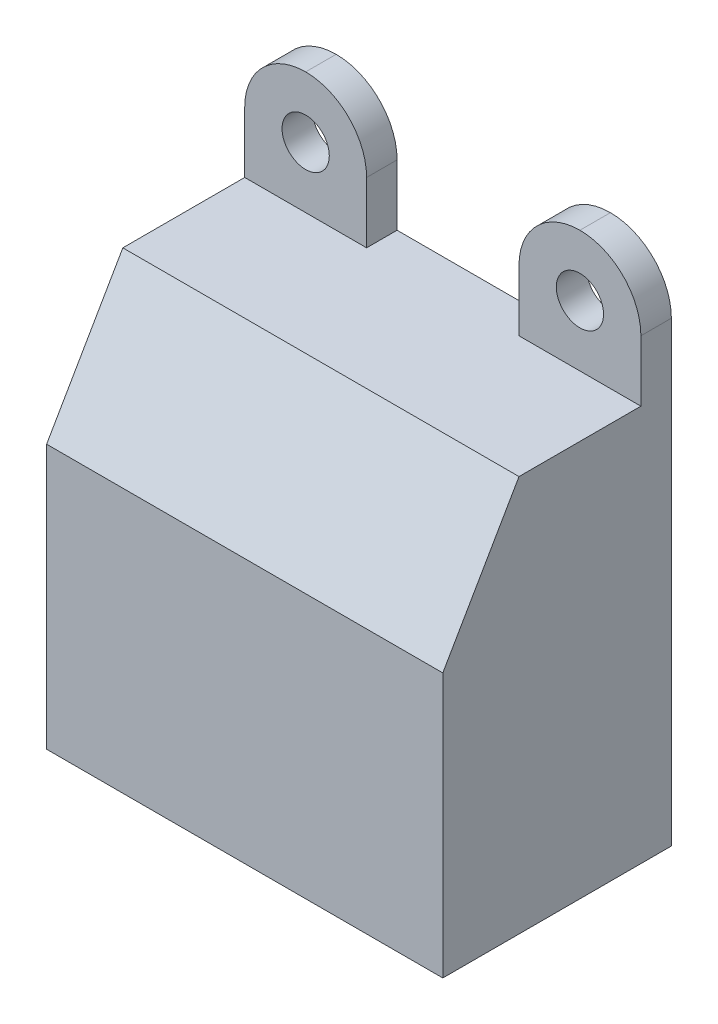
ISO-10303-21;
HEADER;
FILE_DESCRIPTION(('STEP AP214'),'2;1');
FILE_NAME('part.step','',(''),(''),'','','');
FILE_SCHEMA(('AUTOMOTIVE_DESIGN { 1 0 10303 214 1 1 1 1 }'));
ENDSEC;
DATA;
#1=APPLICATION_CONTEXT('core data for automotive mechanical design processes');
#2=APPLICATION_PROTOCOL_DEFINITION('international standard','automotive_design',2000,#1);
#3=PRODUCT_CONTEXT('',#1,'mechanical');
#4=PRODUCT('Part','Part','',(#3));
#5=PRODUCT_RELATED_PRODUCT_CATEGORY('part','',(#4));
#6=PRODUCT_DEFINITION_FORMATION('','',#4);
#7=PRODUCT_DEFINITION_CONTEXT('part definition',#1,'design');
#8=PRODUCT_DEFINITION('design','',#6,#7);
#9=PRODUCT_DEFINITION_SHAPE('','',#8);
#10=(LENGTH_UNIT() NAMED_UNIT(*) SI_UNIT(.MILLI.,.METRE.));
#11=(NAMED_UNIT(*) PLANE_ANGLE_UNIT() SI_UNIT($,.RADIAN.));
#12=(NAMED_UNIT(*) SI_UNIT($,.STERADIAN.) SOLID_ANGLE_UNIT());
#13=UNCERTAINTY_MEASURE_WITH_UNIT(LENGTH_MEASURE(1.E-05),#10,'distance_accuracy_value','');
#14=(GEOMETRIC_REPRESENTATION_CONTEXT(3) GLOBAL_UNCERTAINTY_ASSIGNED_CONTEXT((#13)) GLOBAL_UNIT_ASSIGNED_CONTEXT((#10,
#11,#12)) REPRESENTATION_CONTEXT('',''));
#15=CARTESIAN_POINT('',(0.,0.,0.));
#16=DIRECTION('',(0.,0.,1.));
#17=DIRECTION('',(1.,0.,0.));
#18=AXIS2_PLACEMENT_3D('',#15,#16,#17);
#19=CARTESIAN_POINT('',(70.,26.,15.));
#20=DIRECTION('',(0.,-1.,0.));
#21=DIRECTION('',(1.,0.,0.));
#22=AXIS2_PLACEMENT_3D('',#19,#20,#21);
#23=PLANE('',#22);
#24=DIRECTION('',(0.,0.,1.));
#25=VECTOR('',#24,1.);
#26=CARTESIAN_POINT('',(62.,26.,0.));
#27=LINE('',#26,#25);
#28=CARTESIAN_POINT('',(62.,26.,0.));
#29=VERTEX_POINT('',#28);
#30=CARTESIAN_POINT('',(62.,26.,2.));
#31=VERTEX_POINT('',#30);
#32=EDGE_CURVE('E135',#29,#31,#27,.T.);
#33=ORIENTED_EDGE('',*,*,#32,.F.);
#34=DIRECTION('',(-1.,0.,0.));
#35=VECTOR('',#34,1.);
#36=CARTESIAN_POINT('',(70.,26.,0.));
#37=LINE('',#36,#35);
#38=CARTESIAN_POINT('',(52.,26.,0.));
#39=VERTEX_POINT('',#38);
#40=EDGE_CURVE('E143',#29,#39,#37,.T.);
#41=ORIENTED_EDGE('',*,*,#40,.T.);
#42=DIRECTION('',(0.,0.,-1.));
#43=VECTOR('',#42,1.);
#44=CARTESIAN_POINT('',(52.,26.,0.));
#45=LINE('',#44,#43);
#46=CARTESIAN_POINT('',(52.,26.,2.));
#47=VERTEX_POINT('',#46);
#48=EDGE_CURVE('E173',#47,#39,#45,.T.);
#49=ORIENTED_EDGE('',*,*,#48,.F.);
#50=DIRECTION('',(1.,0.,0.));
#51=VECTOR('',#50,1.);
#52=CARTESIAN_POINT('',(44.,26.,2.));
#53=LINE('',#52,#51);
#54=CARTESIAN_POINT('',(44.,26.,2.));
#55=VERTEX_POINT('',#54);
#56=EDGE_CURVE('E139',#55,#47,#53,.T.);
#57=ORIENTED_EDGE('',*,*,#56,.F.);
#58=DIRECTION('',(0.,0.,-1.));
#59=VECTOR('',#58,1.);
#60=CARTESIAN_POINT('',(44.,26.,15.));
#61=LINE('',#60,#59);
#62=CARTESIAN_POINT('',(44.,26.,9.99999999999999));
#63=VERTEX_POINT('',#62);
#64=EDGE_CURVE('E224',#63,#55,#61,.T.);
#65=ORIENTED_EDGE('',*,*,#64,.F.);
#66=DIRECTION('',(1.,0.,0.));
#67=VECTOR('',#66,1.);
#68=CARTESIAN_POINT('',(70.,26.,9.99999999999999));
#69=LINE('',#68,#67);
#70=CARTESIAN_POINT('',(70.,26.,9.99999999999999));
#71=VERTEX_POINT('',#70);
#72=EDGE_CURVE('E246',#63,#71,#69,.T.);
#73=ORIENTED_EDGE('',*,*,#72,.T.);
#74=DIRECTION('',(0.,0.,-1.));
#75=VECTOR('',#74,1.);
#76=CARTESIAN_POINT('',(70.,26.,15.));
#77=LINE('',#76,#75);
#78=CARTESIAN_POINT('',(70.,26.,2.));
#79=VERTEX_POINT('',#78);
#80=EDGE_CURVE('E227',#71,#79,#77,.T.);
#81=ORIENTED_EDGE('',*,*,#80,.T.);
#82=DIRECTION('',(1.,0.,0.));
#83=VECTOR('',#82,1.);
#84=CARTESIAN_POINT('',(70.,26.,2.));
#85=LINE('',#84,#83);
#86=EDGE_CURVE('E156',#31,#79,#85,.T.);
#87=ORIENTED_EDGE('',*,*,#86,.F.);
#88=EDGE_LOOP('',(#33,#41,#49,#57,#65,#73,#81,#87));
#89=FACE_BOUND('',#88,.T.);
#90=ADVANCED_FACE('F33',(#89),#23,.F.);
#91=CARTESIAN_POINT('',(70.,0.,15.));
#92=DIRECTION('',(-1.,0.,0.));
#93=DIRECTION('',(0.,0.,1.));
#94=AXIS2_PLACEMENT_3D('',#91,#92,#93);
#95=PLANE('',#94);
#96=DIRECTION('',(0.,1.,0.));
#97=VECTOR('',#96,1.);
#98=CARTESIAN_POINT('',(70.,0.,0.));
#99=LINE('',#98,#97);
#100=CARTESIAN_POINT('',(70.,0.,0.));
#101=VERTEX_POINT('',#100);
#102=CARTESIAN_POINT('',(70.,30.,0.));
#103=VERTEX_POINT('',#102);
#104=EDGE_CURVE('E151',#101,#103,#99,.T.);
#105=ORIENTED_EDGE('',*,*,#104,.T.);
#106=DIRECTION('',(0.,0.,-1.));
#107=VECTOR('',#106,1.);
#108=CARTESIAN_POINT('',(70.,30.,15.));
#109=LINE('',#108,#107);
#110=CARTESIAN_POINT('',(70.,30.,2.));
#111=VERTEX_POINT('',#110);
#112=EDGE_CURVE('E193',#103,#111,#109,.F.);
#113=ORIENTED_EDGE('',*,*,#112,.T.);
#114=DIRECTION('',(0.,-1.,0.));
#115=VECTOR('',#114,1.);
#116=CARTESIAN_POINT('',(70.,34.,2.));
#117=LINE('',#116,#115);
#118=EDGE_CURVE('E159',#111,#79,#117,.T.);
#119=ORIENTED_EDGE('',*,*,#118,.T.);
#120=ORIENTED_EDGE('',*,*,#80,.F.);
#121=DIRECTION('',(0.,-0.866025403784438,0.500000000000001));
#122=VECTOR('',#121,1.);
#123=CARTESIAN_POINT('',(70.,17.3397459621556,15.));
#124=LINE('',#123,#122);
#125=CARTESIAN_POINT('',(70.,17.3397459621556,15.));
#126=VERTEX_POINT('',#125);
#127=EDGE_CURVE('E232',#71,#126,#124,.T.);
#128=ORIENTED_EDGE('',*,*,#127,.T.);
#129=DIRECTION('',(0.,1.,0.));
#130=VECTOR('',#129,1.);
#131=CARTESIAN_POINT('',(70.,0.,15.));
#132=LINE('',#131,#130);
#133=CARTESIAN_POINT('',(70.,0.,15.));
#134=VERTEX_POINT('',#133);
#135=EDGE_CURVE('E213',#134,#126,#132,.T.);
#136=ORIENTED_EDGE('',*,*,#135,.F.);
#137=DIRECTION('',(0.,0.,-1.));
#138=VECTOR('',#137,1.);
#139=CARTESIAN_POINT('',(70.,0.,15.));
#140=LINE('',#139,#138);
#141=EDGE_CURVE('E218',#134,#101,#140,.T.);
#142=ORIENTED_EDGE('',*,*,#141,.T.);
#143=EDGE_LOOP('',(#105,#113,#119,#120,#128,#136,#142));
#144=FACE_BOUND('',#143,.T.);
#145=ADVANCED_FACE('F266',(#144),#95,.F.);
#146=CARTESIAN_POINT('',(44.,0.,15.));
#147=DIRECTION('',(1.,0.,0.));
#148=DIRECTION('',(0.,0.,-1.));
#149=AXIS2_PLACEMENT_3D('',#146,#147,#148);
#150=PLANE('',#149);
#151=DIRECTION('',(0.,-1.,0.));
#152=VECTOR('',#151,1.);
#153=CARTESIAN_POINT('',(44.,34.,2.));
#154=LINE('',#153,#152);
#155=CARTESIAN_POINT('',(44.,30.,2.));
#156=VERTEX_POINT('',#155);
#157=EDGE_CURVE('E195',#156,#55,#154,.T.);
#158=ORIENTED_EDGE('',*,*,#157,.F.);
#159=DIRECTION('',(0.,0.,1.));
#160=VECTOR('',#159,1.);
#161=CARTESIAN_POINT('',(44.,30.,0.));
#162=LINE('',#161,#160);
#163=CARTESIAN_POINT('',(44.,30.,0.));
#164=VERTEX_POINT('',#163);
#165=EDGE_CURVE('E42',#156,#164,#162,.F.);
#166=ORIENTED_EDGE('',*,*,#165,.T.);
#167=DIRECTION('',(0.,-1.,0.));
#168=VECTOR('',#167,1.);
#169=CARTESIAN_POINT('',(44.,0.,0.));
#170=LINE('',#169,#168);
#171=CARTESIAN_POINT('',(44.,0.,0.));
#172=VERTEX_POINT('',#171);
#173=EDGE_CURVE('E150',#164,#172,#170,.T.);
#174=ORIENTED_EDGE('',*,*,#173,.T.);
#175=DIRECTION('',(0.,0.,-1.));
#176=VECTOR('',#175,1.);
#177=CARTESIAN_POINT('',(44.,0.,15.));
#178=LINE('',#177,#176);
#179=CARTESIAN_POINT('',(44.,0.,15.));
#180=VERTEX_POINT('',#179);
#181=EDGE_CURVE('E221',#180,#172,#178,.T.);
#182=ORIENTED_EDGE('',*,*,#181,.F.);
#183=DIRECTION('',(0.,-1.,0.));
#184=VECTOR('',#183,1.);
#185=CARTESIAN_POINT('',(44.,0.,15.));
#186=LINE('',#185,#184);
#187=CARTESIAN_POINT('',(44.,17.3397459621556,15.));
#188=VERTEX_POINT('',#187);
#189=EDGE_CURVE('E242',#188,#180,#186,.T.);
#190=ORIENTED_EDGE('',*,*,#189,.F.);
#191=DIRECTION('',(0.,0.866025403784438,-0.500000000000001));
#192=VECTOR('',#191,1.);
#193=CARTESIAN_POINT('',(44.,17.3397459621556,15.));
#194=LINE('',#193,#192);
#195=EDGE_CURVE('E241',#188,#63,#194,.T.);
#196=ORIENTED_EDGE('',*,*,#195,.T.);
#197=ORIENTED_EDGE('',*,*,#64,.T.);
#198=EDGE_LOOP('',(#158,#166,#174,#182,#190,#196,#197));
#199=FACE_BOUND('',#198,.T.);
#200=ADVANCED_FACE('F203',(#199),#150,.F.);
#201=CARTESIAN_POINT('',(70.,0.,15.));
#202=DIRECTION('',(0.,1.,0.));
#203=DIRECTION('',(-1.,0.,0.));
#204=AXIS2_PLACEMENT_3D('',#201,#202,#203);
#205=PLANE('',#204);
#206=DIRECTION('',(1.,0.,0.));
#207=VECTOR('',#206,1.);
#208=CARTESIAN_POINT('',(70.,0.,0.));
#209=LINE('',#208,#207);
#210=EDGE_CURVE('E211',#172,#101,#209,.T.);
#211=ORIENTED_EDGE('',*,*,#210,.T.);
#212=ORIENTED_EDGE('',*,*,#141,.F.);
#213=DIRECTION('',(1.,0.,0.));
#214=VECTOR('',#213,1.);
#215=CARTESIAN_POINT('',(70.,0.,15.));
#216=LINE('',#215,#214);
#217=EDGE_CURVE('E222',#180,#134,#216,.T.);
#218=ORIENTED_EDGE('',*,*,#217,.F.);
#219=ORIENTED_EDGE('',*,*,#181,.T.);
#220=EDGE_LOOP('',(#211,#212,#218,#219));
#221=FACE_BOUND('',#220,.T.);
#222=ADVANCED_FACE('F292',(#221),#205,.F.);
#223=CARTESIAN_POINT('',(0.,0.,15.));
#224=DIRECTION('',(0.,0.,1.));
#225=DIRECTION('',(1.,0.,0.));
#226=AXIS2_PLACEMENT_3D('',#223,#224,#225);
#227=PLANE('',#226);
#228=ORIENTED_EDGE('',*,*,#135,.T.);
#229=DIRECTION('',(-1.,0.,0.));
#230=VECTOR('',#229,1.);
#231=CARTESIAN_POINT('',(44.,17.3397459621556,15.));
#232=LINE('',#231,#230);
#233=EDGE_CURVE('E247',#126,#188,#232,.T.);
#234=ORIENTED_EDGE('',*,*,#233,.T.);
#235=ORIENTED_EDGE('',*,*,#189,.T.);
#236=ORIENTED_EDGE('',*,*,#217,.T.);
#237=EDGE_LOOP('',(#228,#234,#235,#236));
#238=FACE_BOUND('',#237,.T.);
#239=ADVANCED_FACE('F267',(#238),#227,.T.);
#240=CARTESIAN_POINT('',(0.,0.,0.));
#241=DIRECTION('',(0.,0.,1.));
#242=DIRECTION('',(1.,0.,0.));
#243=AXIS2_PLACEMENT_3D('',#240,#241,#242);
#244=PLANE('',#243);
#245=CARTESIAN_POINT('',(48.,30.,0.));
#246=DIRECTION('',(0.,0.,1.));
#247=DIRECTION('',(1.,0.,0.));
#248=AXIS2_PLACEMENT_3D('',#245,#246,#247);
#249=CIRCLE('',#248,1.55);
#250=CARTESIAN_POINT('',(49.55,30.,0.));
#251=VERTEX_POINT('',#250);
#252=EDGE_CURVE('E323',#251,#251,#249,.F.);
#253=ORIENTED_EDGE('',*,*,#252,.F.);
#254=EDGE_LOOP('',(#253));
#255=FACE_BOUND('',#254,.T.);
#256=CARTESIAN_POINT('',(66.,30.,0.));
#257=DIRECTION('',(0.,0.,1.));
#258=DIRECTION('',(1.,0.,0.));
#259=AXIS2_PLACEMENT_3D('',#256,#257,#258);
#260=CIRCLE('',#259,1.55000000000001);
#261=CARTESIAN_POINT('',(67.55,30.,0.));
#262=VERTEX_POINT('',#261);
#263=EDGE_CURVE('E163',#262,#262,#260,.F.);
#264=ORIENTED_EDGE('',*,*,#263,.F.);
#265=EDGE_LOOP('',(#264));
#266=FACE_BOUND('',#265,.T.);
#267=DIRECTION('',(0.,-1.,0.));
#268=VECTOR('',#267,1.);
#269=CARTESIAN_POINT('',(62.,34.,0.));
#270=LINE('',#269,#268);
#271=CARTESIAN_POINT('',(62.,30.,0.));
#272=VERTEX_POINT('',#271);
#273=EDGE_CURVE('E130',#272,#29,#270,.T.);
#274=ORIENTED_EDGE('',*,*,#273,.F.);
#275=CARTESIAN_POINT('',(66.,30.,0.));
#276=DIRECTION('',(0.,0.,1.));
#277=DIRECTION('',(1.,0.,0.));
#278=AXIS2_PLACEMENT_3D('',#275,#276,#277);
#279=CIRCLE('',#278,4.);
#280=CARTESIAN_POINT('',(66.,34.,0.));
#281=VERTEX_POINT('',#280);
#282=EDGE_CURVE('E191',#272,#281,#279,.F.);
#283=ORIENTED_EDGE('',*,*,#282,.T.);
#284=CARTESIAN_POINT('',(66.,30.,0.));
#285=DIRECTION('',(0.,0.,1.));
#286=DIRECTION('',(1.,0.,0.));
#287=AXIS2_PLACEMENT_3D('',#284,#285,#286);
#288=CIRCLE('',#287,4.);
#289=EDGE_CURVE('E189',#281,#103,#288,.F.);
#290=ORIENTED_EDGE('',*,*,#289,.T.);
#291=ORIENTED_EDGE('',*,*,#104,.F.);
#292=ORIENTED_EDGE('',*,*,#210,.F.);
#293=ORIENTED_EDGE('',*,*,#173,.F.);
#294=CARTESIAN_POINT('',(48.,30.,0.));
#295=DIRECTION('',(0.,0.,1.));
#296=DIRECTION('',(1.,0.,0.));
#297=AXIS2_PLACEMENT_3D('',#294,#295,#296);
#298=CIRCLE('',#297,4.);
#299=CARTESIAN_POINT('',(48.,34.,0.));
#300=VERTEX_POINT('',#299);
#301=EDGE_CURVE('E187',#164,#300,#298,.F.);
#302=ORIENTED_EDGE('',*,*,#301,.T.);
#303=CARTESIAN_POINT('',(48.,30.,0.));
#304=DIRECTION('',(0.,0.,1.));
#305=DIRECTION('',(1.,0.,0.));
#306=AXIS2_PLACEMENT_3D('',#303,#304,#305);
#307=CIRCLE('',#306,4.);
#308=CARTESIAN_POINT('',(52.,30.,0.));
#309=VERTEX_POINT('',#308);
#310=EDGE_CURVE('E185',#300,#309,#307,.F.);
#311=ORIENTED_EDGE('',*,*,#310,.T.);
#312=DIRECTION('',(0.,-1.,0.));
#313=VECTOR('',#312,1.);
#314=CARTESIAN_POINT('',(52.,34.,0.));
#315=LINE('',#314,#313);
#316=EDGE_CURVE('E146',#309,#39,#315,.T.);
#317=ORIENTED_EDGE('',*,*,#316,.T.);
#318=ORIENTED_EDGE('',*,*,#40,.F.);
#319=EDGE_LOOP('',(#274,#283,#290,#291,#292,#293,#302,#311,#317,#318));
#320=FACE_BOUND('',#319,.T.);
#321=ADVANCED_FACE('F144',(#255,#266,#320),#244,.F.);
#322=CARTESIAN_POINT('',(0.,17.3397459621556,15.));
#323=DIRECTION('',(0.,0.500000000000001,0.866025403784438));
#324=DIRECTION('',(1.,0.,0.));
#325=AXIS2_PLACEMENT_3D('',#322,#323,#324);
#326=PLANE('',#325);
#327=ORIENTED_EDGE('',*,*,#127,.F.);
#328=ORIENTED_EDGE('',*,*,#72,.F.);
#329=ORIENTED_EDGE('',*,*,#195,.F.);
#330=ORIENTED_EDGE('',*,*,#233,.F.);
#331=EDGE_LOOP('',(#327,#328,#329,#330));
#332=FACE_BOUND('',#331,.T.);
#333=ADVANCED_FACE('F270',(#332),#326,.T.);
#334=CARTESIAN_POINT('',(44.,34.,2.));
#335=DIRECTION('',(0.,0.,-1.));
#336=DIRECTION('',(-1.,0.,0.));
#337=AXIS2_PLACEMENT_3D('',#334,#335,#336);
#338=PLANE('',#337);
#339=CARTESIAN_POINT('',(48.,30.,2.));
#340=DIRECTION('',(0.,0.,1.));
#341=DIRECTION('',(1.,0.,0.));
#342=AXIS2_PLACEMENT_3D('',#339,#340,#341);
#343=CIRCLE('',#342,1.55);
#344=CARTESIAN_POINT('',(49.55,30.,2.));
#345=VERTEX_POINT('',#344);
#346=EDGE_CURVE('E320',#345,#345,#343,.T.);
#347=ORIENTED_EDGE('',*,*,#346,.F.);
#348=EDGE_LOOP('',(#347));
#349=FACE_BOUND('',#348,.T.);
#350=CARTESIAN_POINT('',(48.,30.,2.));
#351=DIRECTION('',(0.,0.,-1.));
#352=DIRECTION('',(-1.,0.,0.));
#353=AXIS2_PLACEMENT_3D('',#350,#351,#352);
#354=CIRCLE('',#353,4.);
#355=CARTESIAN_POINT('',(52.,30.,2.));
#356=VERTEX_POINT('',#355);
#357=CARTESIAN_POINT('',(48.,34.,2.));
#358=VERTEX_POINT('',#357);
#359=EDGE_CURVE('E55',#356,#358,#354,.F.);
#360=ORIENTED_EDGE('',*,*,#359,.T.);
#361=CARTESIAN_POINT('',(48.,30.,2.));
#362=DIRECTION('',(0.,0.,-1.));
#363=DIRECTION('',(-1.,0.,0.));
#364=AXIS2_PLACEMENT_3D('',#361,#362,#363);
#365=CIRCLE('',#364,4.);
#366=EDGE_CURVE('E50',#358,#156,#365,.F.);
#367=ORIENTED_EDGE('',*,*,#366,.T.);
#368=ORIENTED_EDGE('',*,*,#157,.T.);
#369=ORIENTED_EDGE('',*,*,#56,.T.);
#370=DIRECTION('',(0.,-1.,0.));
#371=VECTOR('',#370,1.);
#372=CARTESIAN_POINT('',(52.,34.,2.));
#373=LINE('',#372,#371);
#374=EDGE_CURVE('E170',#356,#47,#373,.T.);
#375=ORIENTED_EDGE('',*,*,#374,.F.);
#376=EDGE_LOOP('',(#360,#367,#368,#369,#375));
#377=FACE_BOUND('',#376,.T.);
#378=ADVANCED_FACE('F237',(#349,#377),#338,.F.);
#379=CARTESIAN_POINT('',(52.,34.,0.));
#380=DIRECTION('',(-1.,0.,0.));
#381=DIRECTION('',(0.,-1.,0.));
#382=AXIS2_PLACEMENT_3D('',#379,#380,#381);
#383=PLANE('',#382);
#384=ORIENTED_EDGE('',*,*,#316,.F.);
#385=DIRECTION('',(0.,0.,-1.));
#386=VECTOR('',#385,1.);
#387=CARTESIAN_POINT('',(52.,30.,2.));
#388=LINE('',#387,#386);
#389=EDGE_CURVE('E11',#309,#356,#388,.F.);
#390=ORIENTED_EDGE('',*,*,#389,.T.);
#391=ORIENTED_EDGE('',*,*,#374,.T.);
#392=ORIENTED_EDGE('',*,*,#48,.T.);
#393=EDGE_LOOP('',(#384,#390,#391,#392));
#394=FACE_BOUND('',#393,.T.);
#395=ADVANCED_FACE('F277',(#394),#383,.F.);
#396=CARTESIAN_POINT('',(62.,34.,0.));
#397=DIRECTION('',(1.,0.,0.));
#398=DIRECTION('',(0.,1.,0.));
#399=AXIS2_PLACEMENT_3D('',#396,#397,#398);
#400=PLANE('',#399);
#401=DIRECTION('',(0.,-1.,0.));
#402=VECTOR('',#401,1.);
#403=CARTESIAN_POINT('',(62.,34.,2.));
#404=LINE('',#403,#402);
#405=CARTESIAN_POINT('',(62.,30.,2.));
#406=VERTEX_POINT('',#405);
#407=EDGE_CURVE('E140',#406,#31,#404,.T.);
#408=ORIENTED_EDGE('',*,*,#407,.F.);
#409=DIRECTION('',(0.,0.,1.));
#410=VECTOR('',#409,1.);
#411=CARTESIAN_POINT('',(62.,30.,0.));
#412=LINE('',#411,#410);
#413=EDGE_CURVE('E137',#406,#272,#412,.F.);
#414=ORIENTED_EDGE('',*,*,#413,.T.);
#415=ORIENTED_EDGE('',*,*,#273,.T.);
#416=ORIENTED_EDGE('',*,*,#32,.T.);
#417=EDGE_LOOP('',(#408,#414,#415,#416));
#418=FACE_BOUND('',#417,.T.);
#419=ADVANCED_FACE('F133',(#418),#400,.F.);
#420=CARTESIAN_POINT('',(70.,34.,2.));
#421=DIRECTION('',(0.,0.,-1.));
#422=DIRECTION('',(-1.,0.,0.));
#423=AXIS2_PLACEMENT_3D('',#420,#421,#422);
#424=PLANE('',#423);
#425=CARTESIAN_POINT('',(66.,30.,2.));
#426=DIRECTION('',(0.,0.,1.));
#427=DIRECTION('',(1.,0.,0.));
#428=AXIS2_PLACEMENT_3D('',#425,#426,#427);
#429=CIRCLE('',#428,1.55000000000001);
#430=CARTESIAN_POINT('',(67.55,30.,2.));
#431=VERTEX_POINT('',#430);
#432=EDGE_CURVE('E324',#431,#431,#429,.T.);
#433=ORIENTED_EDGE('',*,*,#432,.F.);
#434=EDGE_LOOP('',(#433));
#435=FACE_BOUND('',#434,.T.);
#436=CARTESIAN_POINT('',(66.,30.,2.));
#437=DIRECTION('',(0.,0.,-1.));
#438=DIRECTION('',(-1.,0.,0.));
#439=AXIS2_PLACEMENT_3D('',#436,#437,#438);
#440=CIRCLE('',#439,4.);
#441=CARTESIAN_POINT('',(66.,34.,2.));
#442=VERTEX_POINT('',#441);
#443=EDGE_CURVE('E262',#111,#442,#440,.F.);
#444=ORIENTED_EDGE('',*,*,#443,.T.);
#445=CARTESIAN_POINT('',(66.,30.,2.));
#446=DIRECTION('',(0.,0.,-1.));
#447=DIRECTION('',(-1.,0.,0.));
#448=AXIS2_PLACEMENT_3D('',#445,#446,#447);
#449=CIRCLE('',#448,4.);
#450=EDGE_CURVE('E259',#442,#406,#449,.F.);
#451=ORIENTED_EDGE('',*,*,#450,.T.);
#452=ORIENTED_EDGE('',*,*,#407,.T.);
#453=ORIENTED_EDGE('',*,*,#86,.T.);
#454=ORIENTED_EDGE('',*,*,#118,.F.);
#455=EDGE_LOOP('',(#444,#451,#452,#453,#454));
#456=FACE_BOUND('',#455,.T.);
#457=ADVANCED_FACE('F256',(#435,#456),#424,.F.);
#458=CARTESIAN_POINT('',(66.,30.,0.));
#459=DIRECTION('',(0.,0.,-1.));
#460=DIRECTION('',(-1.,0.,0.));
#461=AXIS2_PLACEMENT_3D('',#458,#459,#460);
#462=CYLINDRICAL_SURFACE('',#461,4.);
#463=ORIENTED_EDGE('',*,*,#112,.F.);
#464=ORIENTED_EDGE('',*,*,#289,.F.);
#465=DIRECTION('',(0.,0.,-1.));
#466=VECTOR('',#465,1.);
#467=CARTESIAN_POINT('',(66.,34.,0.));
#468=LINE('',#467,#466);
#469=EDGE_CURVE('E157',#442,#281,#468,.T.);
#470=ORIENTED_EDGE('',*,*,#469,.F.);
#471=ORIENTED_EDGE('',*,*,#443,.F.);
#472=EDGE_LOOP('',(#463,#464,#470,#471));
#473=FACE_BOUND('',#472,.T.);
#474=ADVANCED_FACE('F305',(#473),#462,.T.);
#475=CARTESIAN_POINT('',(66.,30.,0.));
#476=DIRECTION('',(0.,0.,1.));
#477=DIRECTION('',(1.,0.,0.));
#478=AXIS2_PLACEMENT_3D('',#475,#476,#477);
#479=CYLINDRICAL_SURFACE('',#478,4.);
#480=ORIENTED_EDGE('',*,*,#282,.F.);
#481=ORIENTED_EDGE('',*,*,#413,.F.);
#482=ORIENTED_EDGE('',*,*,#450,.F.);
#483=ORIENTED_EDGE('',*,*,#469,.T.);
#484=EDGE_LOOP('',(#480,#481,#482,#483));
#485=FACE_BOUND('',#484,.T.);
#486=ADVANCED_FACE('F261',(#485),#479,.T.);
#487=CARTESIAN_POINT('',(48.,30.,0.));
#488=DIRECTION('',(0.,0.,1.));
#489=DIRECTION('',(1.,0.,0.));
#490=AXIS2_PLACEMENT_3D('',#487,#488,#489);
#491=CYLINDRICAL_SURFACE('',#490,4.);
#492=ORIENTED_EDGE('',*,*,#389,.F.);
#493=ORIENTED_EDGE('',*,*,#310,.F.);
#494=DIRECTION('',(0.,0.,-1.));
#495=VECTOR('',#494,1.);
#496=CARTESIAN_POINT('',(48.,34.,0.));
#497=LINE('',#496,#495);
#498=EDGE_CURVE('E37',#358,#300,#497,.T.);
#499=ORIENTED_EDGE('',*,*,#498,.F.);
#500=ORIENTED_EDGE('',*,*,#359,.F.);
#501=EDGE_LOOP('',(#492,#493,#499,#500));
#502=FACE_BOUND('',#501,.T.);
#503=ADVANCED_FACE('F35',(#502),#491,.T.);
#504=CARTESIAN_POINT('',(48.,30.,0.));
#505=DIRECTION('',(0.,0.,-1.));
#506=DIRECTION('',(-1.,0.,0.));
#507=AXIS2_PLACEMENT_3D('',#504,#505,#506);
#508=CYLINDRICAL_SURFACE('',#507,4.);
#509=ORIENTED_EDGE('',*,*,#301,.F.);
#510=ORIENTED_EDGE('',*,*,#165,.F.);
#511=ORIENTED_EDGE('',*,*,#366,.F.);
#512=ORIENTED_EDGE('',*,*,#498,.T.);
#513=EDGE_LOOP('',(#509,#510,#511,#512));
#514=FACE_BOUND('',#513,.T.);
#515=ADVANCED_FACE('F311',(#514),#508,.T.);
#516=CARTESIAN_POINT('',(66.,30.,-0.00104999999999984));
#517=DIRECTION('',(0.,0.,1.));
#518=DIRECTION('',(1.,0.,0.));
#519=AXIS2_PLACEMENT_3D('',#516,#517,#518);
#520=CYLINDRICAL_SURFACE('',#519,1.55000000000001);
#521=ORIENTED_EDGE('',*,*,#432,.T.);
#522=EDGE_LOOP('',(#521));
#523=FACE_BOUND('',#522,.T.);
#524=ORIENTED_EDGE('',*,*,#263,.T.);
#525=EDGE_LOOP('',(#524));
#526=FACE_BOUND('',#525,.T.);
#527=ADVANCED_FACE('F307',(#523,#526),#520,.F.);
#528=CARTESIAN_POINT('',(48.,30.,-0.00104999999999984));
#529=DIRECTION('',(0.,0.,1.));
#530=DIRECTION('',(1.,0.,0.));
#531=AXIS2_PLACEMENT_3D('',#528,#529,#530);
#532=CYLINDRICAL_SURFACE('',#531,1.55);
#533=ORIENTED_EDGE('',*,*,#346,.T.);
#534=EDGE_LOOP('',(#533));
#535=FACE_BOUND('',#534,.T.);
#536=ORIENTED_EDGE('',*,*,#252,.T.);
#537=EDGE_LOOP('',(#536));
#538=FACE_BOUND('',#537,.T.);
#539=ADVANCED_FACE('F310',(#535,#538),#532,.F.);
#540=CLOSED_SHELL('',(#90,#145,#200,#222,#239,#321,#333,#378,#395,#419,#457,#474,#486,#503,#515,
#527,#539));
#541=MANIFOLD_SOLID_BREP('B2',#540);
#542=ADVANCED_BREP_SHAPE_REPRESENTATION('',(#18,#541),#14);
#543=SHAPE_DEFINITION_REPRESENTATION(#9,#542);
ENDSEC;
END-ISO-10303-21;
